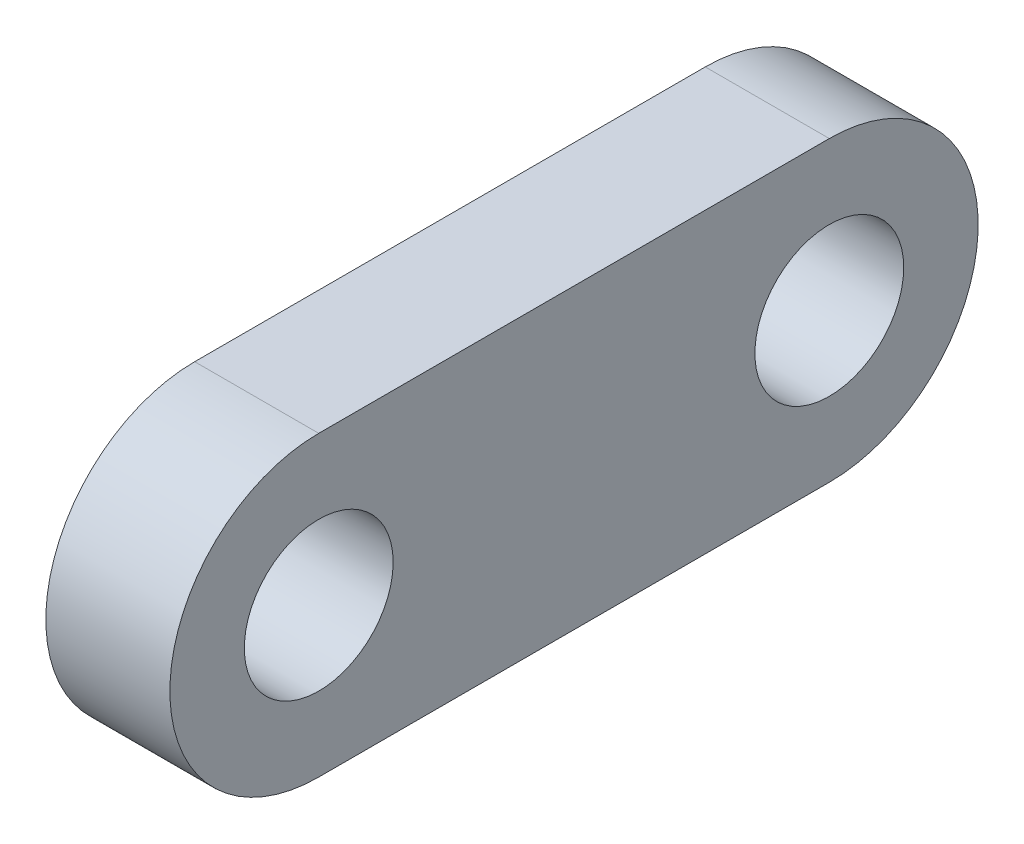
ISO-10303-21;
HEADER;
FILE_DESCRIPTION(('STEP AP214'),'2;1');
FILE_NAME('part.step','',(''),(''),'','','');
FILE_SCHEMA(('AUTOMOTIVE_DESIGN { 1 0 10303 214 1 1 1 1 }'));
ENDSEC;
DATA;
#1=APPLICATION_CONTEXT('core data for automotive mechanical design processes');
#2=APPLICATION_PROTOCOL_DEFINITION('international standard','automotive_design',2000,#1);
#3=PRODUCT_CONTEXT('',#1,'mechanical');
#4=PRODUCT('Part','Part','',(#3));
#5=PRODUCT_RELATED_PRODUCT_CATEGORY('part','',(#4));
#6=PRODUCT_DEFINITION_FORMATION('','',#4);
#7=PRODUCT_DEFINITION_CONTEXT('part definition',#1,'design');
#8=PRODUCT_DEFINITION('design','',#6,#7);
#9=PRODUCT_DEFINITION_SHAPE('','',#8);
#10=(LENGTH_UNIT() NAMED_UNIT(*) SI_UNIT(.MILLI.,.METRE.));
#11=(NAMED_UNIT(*) PLANE_ANGLE_UNIT() SI_UNIT($,.RADIAN.));
#12=(NAMED_UNIT(*) SI_UNIT($,.STERADIAN.) SOLID_ANGLE_UNIT());
#13=UNCERTAINTY_MEASURE_WITH_UNIT(LENGTH_MEASURE(1.E-05),#10,'distance_accuracy_value','');
#14=(GEOMETRIC_REPRESENTATION_CONTEXT(3) GLOBAL_UNCERTAINTY_ASSIGNED_CONTEXT((#13)) GLOBAL_UNIT_ASSIGNED_CONTEXT((#10,
#11,#12)) REPRESENTATION_CONTEXT('',''));
#15=CARTESIAN_POINT('',(0.,0.,0.));
#16=DIRECTION('',(0.,0.,1.));
#17=DIRECTION('',(1.,0.,0.));
#18=AXIS2_PLACEMENT_3D('',#15,#16,#17);
#19=CARTESIAN_POINT('',(5.,0.,21.4348771929824));
#20=DIRECTION('',(1.,0.,0.));
#21=DIRECTION('',(0.,0.,-1.));
#22=AXIS2_PLACEMENT_3D('',#19,#20,#21);
#23=PLANE('',#22);
#24=CARTESIAN_POINT('',(5.,0.,21.4348771929824));
#25=DIRECTION('',(1.,0.,0.));
#26=DIRECTION('',(0.,0.,-1.));
#27=AXIS2_PLACEMENT_3D('',#24,#25,#26);
#28=CIRCLE('',#27,3.);
#29=CARTESIAN_POINT('',(5.,0.,18.4348771929824));
#30=VERTEX_POINT('',#29);
#31=EDGE_CURVE('E100',#30,#30,#28,.T.);
#32=ORIENTED_EDGE('',*,*,#31,.F.);
#33=EDGE_LOOP('',(#32));
#34=FACE_BOUND('',#33,.T.);
#35=CARTESIAN_POINT('',(5.,0.,21.4348771929824));
#36=DIRECTION('',(1.,0.,0.));
#37=DIRECTION('',(0.,0.,-1.));
#38=AXIS2_PLACEMENT_3D('',#35,#36,#37);
#39=CIRCLE('',#38,6.);
#40=CARTESIAN_POINT('',(5.,6.,21.4348771929824));
#41=VERTEX_POINT('',#40);
#42=CARTESIAN_POINT('',(5.,-6.,21.4348771929824));
#43=VERTEX_POINT('',#42);
#44=EDGE_CURVE('E85',#41,#43,#39,.T.);
#45=ORIENTED_EDGE('',*,*,#44,.T.);
#46=DIRECTION('',(0.,0.,-1.));
#47=VECTOR('',#46,1.);
#48=CARTESIAN_POINT('',(5.,-6.,21.4348771929824));
#49=LINE('',#48,#47);
#50=CARTESIAN_POINT('',(5.,-6.,0.854877192982451));
#51=VERTEX_POINT('',#50);
#52=EDGE_CURVE('E80',#43,#51,#49,.T.);
#53=ORIENTED_EDGE('',*,*,#52,.T.);
#54=CARTESIAN_POINT('',(5.,0.,0.85487719298245));
#55=DIRECTION('',(1.,0.,0.));
#56=DIRECTION('',(0.,0.,-1.));
#57=AXIS2_PLACEMENT_3D('',#54,#55,#56);
#58=CIRCLE('',#57,6.);
#59=CARTESIAN_POINT('',(5.,6.,0.85487719298245));
#60=VERTEX_POINT('',#59);
#61=EDGE_CURVE('E83',#51,#60,#58,.T.);
#62=ORIENTED_EDGE('',*,*,#61,.T.);
#63=DIRECTION('',(0.,0.,1.));
#64=VECTOR('',#63,1.);
#65=CARTESIAN_POINT('',(5.,6.,21.4348771929824));
#66=LINE('',#65,#64);
#67=EDGE_CURVE('E50',#60,#41,#66,.T.);
#68=ORIENTED_EDGE('',*,*,#67,.T.);
#69=EDGE_LOOP('',(#45,#53,#62,#68));
#70=FACE_BOUND('',#69,.T.);
#71=CARTESIAN_POINT('',(5.,0.,0.85487719298245));
#72=DIRECTION('',(1.,0.,0.));
#73=DIRECTION('',(0.,0.,-1.));
#74=AXIS2_PLACEMENT_3D('',#71,#72,#73);
#75=CIRCLE('',#74,2.99999999999999);
#76=CARTESIAN_POINT('',(5.,0.,-2.14512280701754));
#77=VERTEX_POINT('',#76);
#78=EDGE_CURVE('E115',#77,#77,#75,.T.);
#79=ORIENTED_EDGE('',*,*,#78,.F.);
#80=EDGE_LOOP('',(#79));
#81=FACE_BOUND('',#80,.T.);
#82=ADVANCED_FACE('F33',(#34,#70,#81),#23,.T.);
#83=CARTESIAN_POINT('',(0.,0.,21.4348771929824));
#84=DIRECTION('',(1.,0.,0.));
#85=DIRECTION('',(0.,0.,-1.));
#86=AXIS2_PLACEMENT_3D('',#83,#84,#85);
#87=PLANE('',#86);
#88=CARTESIAN_POINT('',(0.,0.,21.4348771929824));
#89=DIRECTION('',(1.,0.,0.));
#90=DIRECTION('',(0.,0.,-1.));
#91=AXIS2_PLACEMENT_3D('',#88,#89,#90);
#92=CIRCLE('',#91,6.);
#93=CARTESIAN_POINT('',(0.,6.,21.4348771929824));
#94=VERTEX_POINT('',#93);
#95=CARTESIAN_POINT('',(0.,-6.,21.4348771929824));
#96=VERTEX_POINT('',#95);
#97=EDGE_CURVE('E97',#94,#96,#92,.T.);
#98=ORIENTED_EDGE('',*,*,#97,.F.);
#99=DIRECTION('',(0.,0.,1.));
#100=VECTOR('',#99,1.);
#101=CARTESIAN_POINT('',(0.,6.,21.4348771929824));
#102=LINE('',#101,#100);
#103=CARTESIAN_POINT('',(0.,6.,0.85487719298245));
#104=VERTEX_POINT('',#103);
#105=EDGE_CURVE('E73',#104,#94,#102,.T.);
#106=ORIENTED_EDGE('',*,*,#105,.F.);
#107=CARTESIAN_POINT('',(0.,0.,0.85487719298245));
#108=DIRECTION('',(1.,0.,0.));
#109=DIRECTION('',(0.,0.,-1.));
#110=AXIS2_PLACEMENT_3D('',#107,#108,#109);
#111=CIRCLE('',#110,6.);
#112=CARTESIAN_POINT('',(0.,-6.,0.854877192982451));
#113=VERTEX_POINT('',#112);
#114=EDGE_CURVE('E67',#113,#104,#111,.T.);
#115=ORIENTED_EDGE('',*,*,#114,.F.);
#116=DIRECTION('',(0.,0.,-1.));
#117=VECTOR('',#116,1.);
#118=CARTESIAN_POINT('',(0.,-6.,21.4348771929824));
#119=LINE('',#118,#117);
#120=EDGE_CURVE('E89',#96,#113,#119,.T.);
#121=ORIENTED_EDGE('',*,*,#120,.F.);
#122=EDGE_LOOP('',(#98,#106,#115,#121));
#123=FACE_BOUND('',#122,.T.);
#124=CARTESIAN_POINT('',(0.,0.,21.4348771929824));
#125=DIRECTION('',(1.,0.,0.));
#126=DIRECTION('',(0.,0.,-1.));
#127=AXIS2_PLACEMENT_3D('',#124,#125,#126);
#128=CIRCLE('',#127,3.);
#129=CARTESIAN_POINT('',(0.,0.,18.4348771929824));
#130=VERTEX_POINT('',#129);
#131=EDGE_CURVE('E112',#130,#130,#128,.T.);
#132=ORIENTED_EDGE('',*,*,#131,.T.);
#133=EDGE_LOOP('',(#132));
#134=FACE_BOUND('',#133,.T.);
#135=CARTESIAN_POINT('',(0.,0.,0.85487719298245));
#136=DIRECTION('',(1.,0.,0.));
#137=DIRECTION('',(0.,0.,-1.));
#138=AXIS2_PLACEMENT_3D('',#135,#136,#137);
#139=CIRCLE('',#138,2.99999999999999);
#140=CARTESIAN_POINT('',(0.,0.,-2.14512280701754));
#141=VERTEX_POINT('',#140);
#142=EDGE_CURVE('E118',#141,#141,#139,.T.);
#143=ORIENTED_EDGE('',*,*,#142,.T.);
#144=EDGE_LOOP('',(#143));
#145=FACE_BOUND('',#144,.T.);
#146=ADVANCED_FACE('F108',(#123,#134,#145),#87,.F.);
#147=CARTESIAN_POINT('',(5.,0.,21.4348771929824));
#148=DIRECTION('',(-1.,0.,0.));
#149=DIRECTION('',(0.,0.,1.));
#150=AXIS2_PLACEMENT_3D('',#147,#148,#149);
#151=CYLINDRICAL_SURFACE('',#150,6.);
#152=ORIENTED_EDGE('',*,*,#97,.T.);
#153=DIRECTION('',(-1.,0.,0.));
#154=VECTOR('',#153,1.);
#155=CARTESIAN_POINT('',(5.,-6.,21.4348771929824));
#156=LINE('',#155,#154);
#157=EDGE_CURVE('E11',#43,#96,#156,.T.);
#158=ORIENTED_EDGE('',*,*,#157,.F.);
#159=ORIENTED_EDGE('',*,*,#44,.F.);
#160=DIRECTION('',(-1.,0.,0.));
#161=VECTOR('',#160,1.);
#162=CARTESIAN_POINT('',(5.,6.,21.4348771929824));
#163=LINE('',#162,#161);
#164=EDGE_CURVE('E93',#41,#94,#163,.T.);
#165=ORIENTED_EDGE('',*,*,#164,.T.);
#166=EDGE_LOOP('',(#152,#158,#159,#165));
#167=FACE_BOUND('',#166,.T.);
#168=ADVANCED_FACE('F35',(#167),#151,.T.);
#169=CARTESIAN_POINT('',(5.,-6.,21.4348771929824));
#170=DIRECTION('',(0.,1.,0.));
#171=DIRECTION('',(0.,0.,1.));
#172=AXIS2_PLACEMENT_3D('',#169,#170,#171);
#173=PLANE('',#172);
#174=ORIENTED_EDGE('',*,*,#120,.T.);
#175=DIRECTION('',(-1.,0.,0.));
#176=VECTOR('',#175,1.);
#177=CARTESIAN_POINT('',(5.,-6.,0.854877192982451));
#178=LINE('',#177,#176);
#179=EDGE_CURVE('E42',#51,#113,#178,.T.);
#180=ORIENTED_EDGE('',*,*,#179,.F.);
#181=ORIENTED_EDGE('',*,*,#52,.F.);
#182=ORIENTED_EDGE('',*,*,#157,.T.);
#183=EDGE_LOOP('',(#174,#180,#181,#182));
#184=FACE_BOUND('',#183,.T.);
#185=ADVANCED_FACE('F88',(#184),#173,.F.);
#186=CARTESIAN_POINT('',(5.,0.,0.85487719298245));
#187=DIRECTION('',(-1.,0.,0.));
#188=DIRECTION('',(0.,0.,1.));
#189=AXIS2_PLACEMENT_3D('',#186,#187,#188);
#190=CYLINDRICAL_SURFACE('',#189,6.);
#191=ORIENTED_EDGE('',*,*,#114,.T.);
#192=DIRECTION('',(-1.,0.,0.));
#193=VECTOR('',#192,1.);
#194=CARTESIAN_POINT('',(5.,6.,0.85487719298245));
#195=LINE('',#194,#193);
#196=EDGE_CURVE('E90',#60,#104,#195,.T.);
#197=ORIENTED_EDGE('',*,*,#196,.F.);
#198=ORIENTED_EDGE('',*,*,#61,.F.);
#199=ORIENTED_EDGE('',*,*,#179,.T.);
#200=EDGE_LOOP('',(#191,#197,#198,#199));
#201=FACE_BOUND('',#200,.T.);
#202=ADVANCED_FACE('F91',(#201),#190,.T.);
#203=CARTESIAN_POINT('',(5.,6.,21.4348771929824));
#204=DIRECTION('',(0.,-1.,0.));
#205=DIRECTION('',(0.,0.,-1.));
#206=AXIS2_PLACEMENT_3D('',#203,#204,#205);
#207=PLANE('',#206);
#208=ORIENTED_EDGE('',*,*,#105,.T.);
#209=ORIENTED_EDGE('',*,*,#164,.F.);
#210=ORIENTED_EDGE('',*,*,#67,.F.);
#211=ORIENTED_EDGE('',*,*,#196,.T.);
#212=EDGE_LOOP('',(#208,#209,#210,#211));
#213=FACE_BOUND('',#212,.T.);
#214=ADVANCED_FACE('F105',(#213),#207,.F.);
#215=CARTESIAN_POINT('',(5.,0.,21.4348771929824));
#216=DIRECTION('',(-1.,0.,0.));
#217=DIRECTION('',(0.,0.,1.));
#218=AXIS2_PLACEMENT_3D('',#215,#216,#217);
#219=CYLINDRICAL_SURFACE('',#218,3.);
#220=ORIENTED_EDGE('',*,*,#31,.T.);
#221=EDGE_LOOP('',(#220));
#222=FACE_BOUND('',#221,.T.);
#223=ORIENTED_EDGE('',*,*,#131,.F.);
#224=EDGE_LOOP('',(#223));
#225=FACE_BOUND('',#224,.T.);
#226=ADVANCED_FACE('F135',(#222,#225),#219,.F.);
#227=CARTESIAN_POINT('',(5.,0.,0.85487719298245));
#228=DIRECTION('',(-1.,0.,0.));
#229=DIRECTION('',(0.,0.,1.));
#230=AXIS2_PLACEMENT_3D('',#227,#228,#229);
#231=CYLINDRICAL_SURFACE('',#230,2.99999999999999);
#232=ORIENTED_EDGE('',*,*,#78,.T.);
#233=EDGE_LOOP('',(#232));
#234=FACE_BOUND('',#233,.T.);
#235=ORIENTED_EDGE('',*,*,#142,.F.);
#236=EDGE_LOOP('',(#235));
#237=FACE_BOUND('',#236,.T.);
#238=ADVANCED_FACE('F124',(#234,#237),#231,.F.);
#239=CLOSED_SHELL('',(#82,#146,#168,#185,#202,#214,#226,#238));
#240=MANIFOLD_SOLID_BREP('B2',#239);
#241=ADVANCED_BREP_SHAPE_REPRESENTATION('',(#18,#240),#14);
#242=SHAPE_DEFINITION_REPRESENTATION(#9,#241);
ENDSEC;
END-ISO-10303-21;
